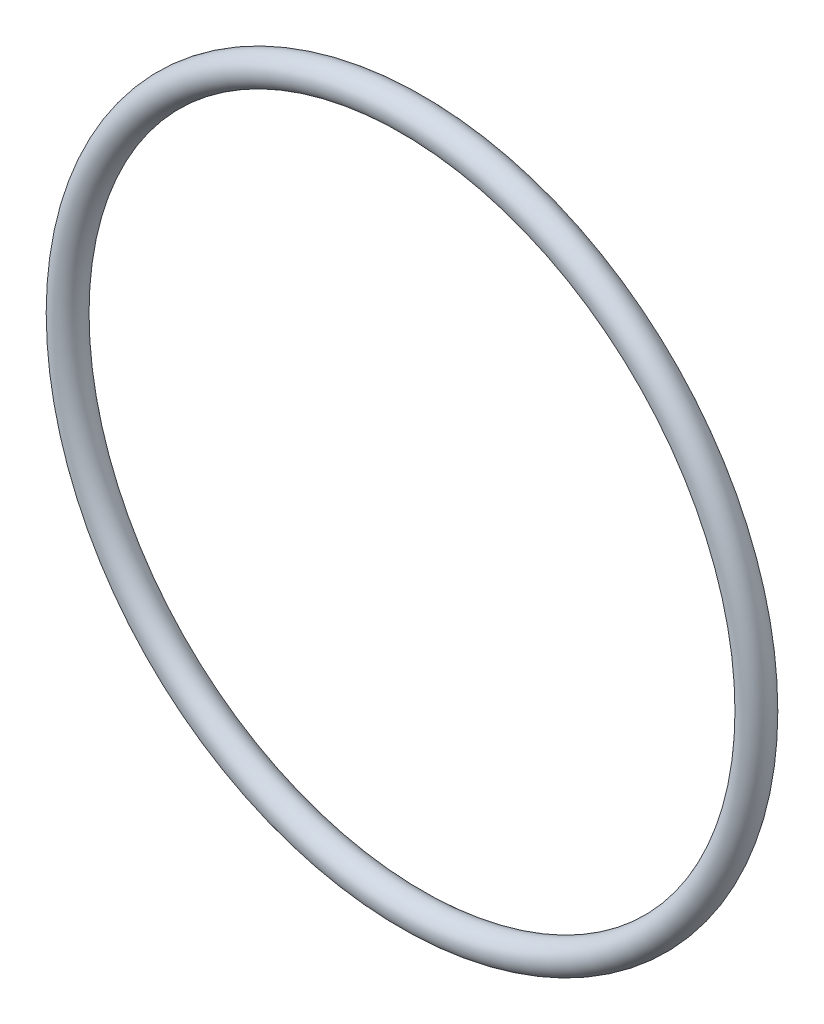
ISO-10303-21;
HEADER;
FILE_DESCRIPTION(('STEP AP214'),'2;1');
FILE_NAME('part.step','',(''),(''),'','','');
FILE_SCHEMA(('AUTOMOTIVE_DESIGN { 1 0 10303 214 1 1 1 1 }'));
ENDSEC;
DATA;
#1=APPLICATION_CONTEXT('core data for automotive mechanical design processes');
#2=APPLICATION_PROTOCOL_DEFINITION('international standard','automotive_design',2000,#1);
#3=PRODUCT_CONTEXT('',#1,'mechanical');
#4=PRODUCT('Part','Part','',(#3));
#5=PRODUCT_RELATED_PRODUCT_CATEGORY('part','',(#4));
#6=PRODUCT_DEFINITION_FORMATION('','',#4);
#7=PRODUCT_DEFINITION_CONTEXT('part definition',#1,'design');
#8=PRODUCT_DEFINITION('design','',#6,#7);
#9=PRODUCT_DEFINITION_SHAPE('','',#8);
#10=(LENGTH_UNIT() NAMED_UNIT(*) SI_UNIT(.MILLI.,.METRE.));
#11=(NAMED_UNIT(*) PLANE_ANGLE_UNIT() SI_UNIT($,.RADIAN.));
#12=(NAMED_UNIT(*) SI_UNIT($,.STERADIAN.) SOLID_ANGLE_UNIT());
#13=UNCERTAINTY_MEASURE_WITH_UNIT(LENGTH_MEASURE(1.E-05),#10,'distance_accuracy_value','');
#14=(GEOMETRIC_REPRESENTATION_CONTEXT(3) GLOBAL_UNCERTAINTY_ASSIGNED_CONTEXT((#13)) GLOBAL_UNIT_ASSIGNED_CONTEXT((#10,
#11,#12)) REPRESENTATION_CONTEXT('',''));
#15=CARTESIAN_POINT('',(0.,0.,0.));
#16=DIRECTION('',(0.,0.,1.));
#17=DIRECTION('',(1.,0.,0.));
#18=AXIS2_PLACEMENT_3D('',#15,#16,#17);
#19=CARTESIAN_POINT('',(0.,0.,0.));
#20=DIRECTION('',(0.,0.,1.));
#21=DIRECTION('',(1.,0.,0.));
#22=AXIS2_PLACEMENT_3D('',#19,#20,#21);
#23=TOROIDAL_SURFACE('',#22,29.718,1.3081);
#24=CARTESIAN_POINT('',(31.0261,0.,0.));
#25=VERTEX_POINT('',#24);
#26=VERTEX_LOOP('',#25);
#27=FACE_BOUND('',#26,.T.);
#28=ADVANCED_FACE('F32',(#27),#23,.T.);
#29=CLOSED_SHELL('',(#28));
#30=MANIFOLD_SOLID_BREP('B2',#29);
#31=ADVANCED_BREP_SHAPE_REPRESENTATION('',(#18,#30),#14);
#32=SHAPE_DEFINITION_REPRESENTATION(#9,#31);
ENDSEC;
END-ISO-10303-21;
